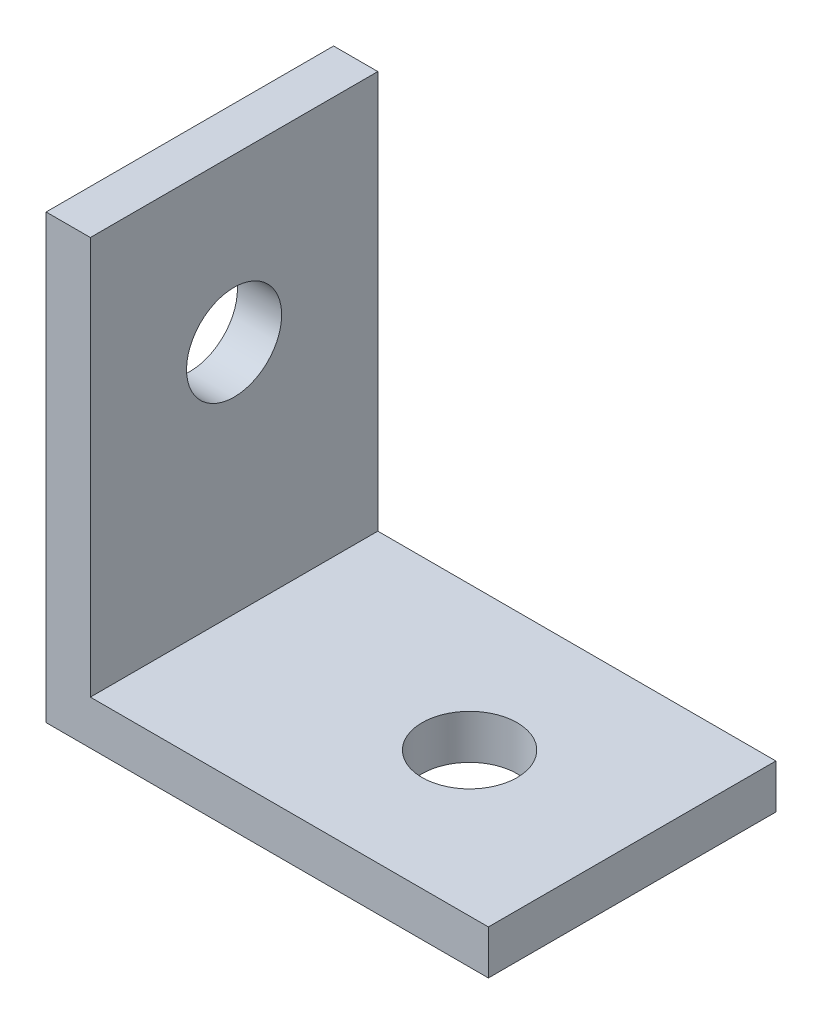
ISO-10303-21;
HEADER;
FILE_DESCRIPTION(('STEP AP214'),'2;1');
FILE_NAME('part.step','',(''),(''),'','','');
FILE_SCHEMA(('AUTOMOTIVE_DESIGN { 1 0 10303 214 1 1 1 1 }'));
ENDSEC;
DATA;
#1=APPLICATION_CONTEXT('core data for automotive mechanical design processes');
#2=APPLICATION_PROTOCOL_DEFINITION('international standard','automotive_design',2000,#1);
#3=PRODUCT_CONTEXT('',#1,'mechanical');
#4=PRODUCT('Part','Part','',(#3));
#5=PRODUCT_RELATED_PRODUCT_CATEGORY('part','',(#4));
#6=PRODUCT_DEFINITION_FORMATION('','',#4);
#7=PRODUCT_DEFINITION_CONTEXT('part definition',#1,'design');
#8=PRODUCT_DEFINITION('design','',#6,#7);
#9=PRODUCT_DEFINITION_SHAPE('','',#8);
#10=(LENGTH_UNIT() NAMED_UNIT(*) SI_UNIT(.MILLI.,.METRE.));
#11=(NAMED_UNIT(*) PLANE_ANGLE_UNIT() SI_UNIT($,.RADIAN.));
#12=(NAMED_UNIT(*) SI_UNIT($,.STERADIAN.) SOLID_ANGLE_UNIT());
#13=UNCERTAINTY_MEASURE_WITH_UNIT(LENGTH_MEASURE(1.E-05),#10,'distance_accuracy_value','');
#14=(GEOMETRIC_REPRESENTATION_CONTEXT(3) GLOBAL_UNCERTAINTY_ASSIGNED_CONTEXT((#13)) GLOBAL_UNIT_ASSIGNED_CONTEXT((#10,
#11,#12)) REPRESENTATION_CONTEXT('',''));
#15=CARTESIAN_POINT('',(0.,0.,0.));
#16=DIRECTION('',(0.,0.,1.));
#17=DIRECTION('',(1.,0.,0.));
#18=AXIS2_PLACEMENT_3D('',#15,#16,#17);
#19=CARTESIAN_POINT('',(2.,20.,13.));
#20=DIRECTION('',(0.,-1.,0.));
#21=DIRECTION('',(0.,0.,-1.));
#22=AXIS2_PLACEMENT_3D('',#19,#20,#21);
#23=PLANE('',#22);
#24=DIRECTION('',(-1.,0.,0.));
#25=VECTOR('',#24,1.);
#26=CARTESIAN_POINT('',(2.,20.,0.));
#27=LINE('',#26,#25);
#28=CARTESIAN_POINT('',(2.,20.,0.));
#29=VERTEX_POINT('',#28);
#30=CARTESIAN_POINT('',(0.,20.,0.));
#31=VERTEX_POINT('',#30);
#32=EDGE_CURVE('E119',#29,#31,#27,.T.);
#33=ORIENTED_EDGE('',*,*,#32,.T.);
#34=DIRECTION('',(0.,0.,-1.));
#35=VECTOR('',#34,1.);
#36=CARTESIAN_POINT('',(0.,20.,13.));
#37=LINE('',#36,#35);
#38=CARTESIAN_POINT('',(0.,20.,13.));
#39=VERTEX_POINT('',#38);
#40=EDGE_CURVE('E11',#39,#31,#37,.T.);
#41=ORIENTED_EDGE('',*,*,#40,.F.);
#42=DIRECTION('',(-1.,0.,0.));
#43=VECTOR('',#42,1.);
#44=CARTESIAN_POINT('',(2.,20.,13.));
#45=LINE('',#44,#43);
#46=CARTESIAN_POINT('',(2.,20.,13.));
#47=VERTEX_POINT('',#46);
#48=EDGE_CURVE('E130',#47,#39,#45,.T.);
#49=ORIENTED_EDGE('',*,*,#48,.F.);
#50=DIRECTION('',(0.,0.,-1.));
#51=VECTOR('',#50,1.);
#52=CARTESIAN_POINT('',(2.,20.,13.));
#53=LINE('',#52,#51);
#54=EDGE_CURVE('E115',#47,#29,#53,.T.);
#55=ORIENTED_EDGE('',*,*,#54,.T.);
#56=EDGE_LOOP('',(#33,#41,#49,#55));
#57=FACE_BOUND('',#56,.T.);
#58=ADVANCED_FACE('F33',(#57),#23,.F.);
#59=CARTESIAN_POINT('',(0.,20.,13.));
#60=DIRECTION('',(1.,0.,0.));
#61=DIRECTION('',(0.,1.,0.));
#62=AXIS2_PLACEMENT_3D('',#59,#60,#61);
#63=PLANE('',#62);
#64=CARTESIAN_POINT('',(0.,12.65,6.5));
#65=DIRECTION('',(-1.,0.,0.));
#66=DIRECTION('',(0.,-1.,0.));
#67=AXIS2_PLACEMENT_3D('',#64,#65,#66);
#68=CIRCLE('',#67,2.15);
#69=CARTESIAN_POINT('',(0.,10.5,6.5));
#70=VERTEX_POINT('',#69);
#71=EDGE_CURVE('E136',#70,#70,#68,.T.);
#72=ORIENTED_EDGE('',*,*,#71,.F.);
#73=EDGE_LOOP('',(#72));
#74=FACE_BOUND('',#73,.T.);
#75=DIRECTION('',(0.,-1.,0.));
#76=VECTOR('',#75,1.);
#77=CARTESIAN_POINT('',(0.,20.,0.));
#78=LINE('',#77,#76);
#79=CARTESIAN_POINT('',(0.,0.,0.));
#80=VERTEX_POINT('',#79);
#81=EDGE_CURVE('E122',#31,#80,#78,.T.);
#82=ORIENTED_EDGE('',*,*,#81,.T.);
#83=DIRECTION('',(0.,0.,-1.));
#84=VECTOR('',#83,1.);
#85=CARTESIAN_POINT('',(0.,0.,13.));
#86=LINE('',#85,#84);
#87=CARTESIAN_POINT('',(0.,0.,13.));
#88=VERTEX_POINT('',#87);
#89=EDGE_CURVE('E42',#88,#80,#86,.T.);
#90=ORIENTED_EDGE('',*,*,#89,.F.);
#91=DIRECTION('',(0.,-1.,0.));
#92=VECTOR('',#91,1.);
#93=CARTESIAN_POINT('',(0.,20.,13.));
#94=LINE('',#93,#92);
#95=EDGE_CURVE('E88',#39,#88,#94,.T.);
#96=ORIENTED_EDGE('',*,*,#95,.F.);
#97=ORIENTED_EDGE('',*,*,#40,.T.);
#98=EDGE_LOOP('',(#82,#90,#96,#97));
#99=FACE_BOUND('',#98,.T.);
#100=ADVANCED_FACE('F150',(#74,#99),#63,.F.);
#101=CARTESIAN_POINT('',(0.,0.,13.));
#102=DIRECTION('',(0.,1.,0.));
#103=DIRECTION('',(0.,0.,1.));
#104=AXIS2_PLACEMENT_3D('',#101,#102,#103);
#105=PLANE('',#104);
#106=CARTESIAN_POINT('',(12.65,0.,6.5));
#107=DIRECTION('',(0.,-1.,0.));
#108=DIRECTION('',(0.,0.,-1.));
#109=AXIS2_PLACEMENT_3D('',#106,#107,#108);
#110=CIRCLE('',#109,2.15);
#111=CARTESIAN_POINT('',(12.65,0.,4.35));
#112=VERTEX_POINT('',#111);
#113=EDGE_CURVE('E144',#112,#112,#110,.T.);
#114=ORIENTED_EDGE('',*,*,#113,.F.);
#115=EDGE_LOOP('',(#114));
#116=FACE_BOUND('',#115,.T.);
#117=DIRECTION('',(1.,0.,0.));
#118=VECTOR('',#117,1.);
#119=CARTESIAN_POINT('',(0.,0.,0.));
#120=LINE('',#119,#118);
#121=CARTESIAN_POINT('',(20.,0.,0.));
#122=VERTEX_POINT('',#121);
#123=EDGE_CURVE('E125',#80,#122,#120,.T.);
#124=ORIENTED_EDGE('',*,*,#123,.T.);
#125=DIRECTION('',(0.,0.,-1.));
#126=VECTOR('',#125,1.);
#127=CARTESIAN_POINT('',(20.,0.,13.));
#128=LINE('',#127,#126);
#129=CARTESIAN_POINT('',(20.,0.,13.));
#130=VERTEX_POINT('',#129);
#131=EDGE_CURVE('E110',#130,#122,#128,.T.);
#132=ORIENTED_EDGE('',*,*,#131,.F.);
#133=DIRECTION('',(1.,0.,0.));
#134=VECTOR('',#133,1.);
#135=CARTESIAN_POINT('',(0.,0.,13.));
#136=LINE('',#135,#134);
#137=EDGE_CURVE('E101',#88,#130,#136,.T.);
#138=ORIENTED_EDGE('',*,*,#137,.F.);
#139=ORIENTED_EDGE('',*,*,#89,.T.);
#140=EDGE_LOOP('',(#124,#132,#138,#139));
#141=FACE_BOUND('',#140,.T.);
#142=ADVANCED_FACE('F153',(#116,#141),#105,.F.);
#143=CARTESIAN_POINT('',(20.,0.,13.));
#144=DIRECTION('',(-1.,0.,0.));
#145=DIRECTION('',(0.,0.,1.));
#146=AXIS2_PLACEMENT_3D('',#143,#144,#145);
#147=PLANE('',#146);
#148=DIRECTION('',(0.,1.,0.));
#149=VECTOR('',#148,1.);
#150=CARTESIAN_POINT('',(20.,0.,0.));
#151=LINE('',#150,#149);
#152=CARTESIAN_POINT('',(20.,2.,0.));
#153=VERTEX_POINT('',#152);
#154=EDGE_CURVE('E109',#122,#153,#151,.T.);
#155=ORIENTED_EDGE('',*,*,#154,.T.);
#156=DIRECTION('',(0.,0.,-1.));
#157=VECTOR('',#156,1.);
#158=CARTESIAN_POINT('',(20.,2.,13.));
#159=LINE('',#158,#157);
#160=CARTESIAN_POINT('',(20.,2.,13.));
#161=VERTEX_POINT('',#160);
#162=EDGE_CURVE('E106',#161,#153,#159,.T.);
#163=ORIENTED_EDGE('',*,*,#162,.F.);
#164=DIRECTION('',(0.,1.,0.));
#165=VECTOR('',#164,1.);
#166=CARTESIAN_POINT('',(20.,0.,13.));
#167=LINE('',#166,#165);
#168=EDGE_CURVE('E95',#130,#161,#167,.T.);
#169=ORIENTED_EDGE('',*,*,#168,.F.);
#170=ORIENTED_EDGE('',*,*,#131,.T.);
#171=EDGE_LOOP('',(#155,#163,#169,#170));
#172=FACE_BOUND('',#171,.T.);
#173=ADVANCED_FACE('F107',(#172),#147,.F.);
#174=CARTESIAN_POINT('',(20.,2.,13.));
#175=DIRECTION('',(0.,-1.,0.));
#176=DIRECTION('',(1.,0.,0.));
#177=AXIS2_PLACEMENT_3D('',#174,#175,#176);
#178=PLANE('',#177);
#179=CARTESIAN_POINT('',(12.65,2.,6.5));
#180=DIRECTION('',(0.,-1.,0.));
#181=DIRECTION('',(1.,0.,0.));
#182=AXIS2_PLACEMENT_3D('',#179,#180,#181);
#183=CIRCLE('',#182,2.15);
#184=CARTESIAN_POINT('',(14.8,2.,6.5));
#185=VERTEX_POINT('',#184);
#186=EDGE_CURVE('E36',#185,#185,#183,.T.);
#187=ORIENTED_EDGE('',*,*,#186,.T.);
#188=EDGE_LOOP('',(#187));
#189=FACE_BOUND('',#188,.T.);
#190=DIRECTION('',(-1.,0.,0.));
#191=VECTOR('',#190,1.);
#192=CARTESIAN_POINT('',(20.,2.,0.));
#193=LINE('',#192,#191);
#194=CARTESIAN_POINT('',(2.,2.,0.));
#195=VERTEX_POINT('',#194);
#196=EDGE_CURVE('E74',#153,#195,#193,.T.);
#197=ORIENTED_EDGE('',*,*,#196,.T.);
#198=DIRECTION('',(0.,0.,-1.));
#199=VECTOR('',#198,1.);
#200=CARTESIAN_POINT('',(2.,2.,13.));
#201=LINE('',#200,#199);
#202=CARTESIAN_POINT('',(2.,2.,13.));
#203=VERTEX_POINT('',#202);
#204=EDGE_CURVE('E111',#203,#195,#201,.T.);
#205=ORIENTED_EDGE('',*,*,#204,.F.);
#206=DIRECTION('',(-1.,0.,0.));
#207=VECTOR('',#206,1.);
#208=CARTESIAN_POINT('',(20.,2.,13.));
#209=LINE('',#208,#207);
#210=EDGE_CURVE('E99',#161,#203,#209,.T.);
#211=ORIENTED_EDGE('',*,*,#210,.F.);
#212=ORIENTED_EDGE('',*,*,#162,.T.);
#213=EDGE_LOOP('',(#197,#205,#211,#212));
#214=FACE_BOUND('',#213,.T.);
#215=ADVANCED_FACE('F113',(#189,#214),#178,.F.);
#216=CARTESIAN_POINT('',(2.,2.,13.));
#217=DIRECTION('',(-1.,0.,0.));
#218=DIRECTION('',(0.,-1.,0.));
#219=AXIS2_PLACEMENT_3D('',#216,#217,#218);
#220=PLANE('',#219);
#221=CARTESIAN_POINT('',(2.,12.65,6.5));
#222=DIRECTION('',(-1.,0.,0.));
#223=DIRECTION('',(0.,-1.,0.));
#224=AXIS2_PLACEMENT_3D('',#221,#222,#223);
#225=CIRCLE('',#224,2.15);
#226=CARTESIAN_POINT('',(2.,10.5,6.5));
#227=VERTEX_POINT('',#226);
#228=EDGE_CURVE('E123',#227,#227,#225,.T.);
#229=ORIENTED_EDGE('',*,*,#228,.T.);
#230=EDGE_LOOP('',(#229));
#231=FACE_BOUND('',#230,.T.);
#232=DIRECTION('',(0.,1.,0.));
#233=VECTOR('',#232,1.);
#234=CARTESIAN_POINT('',(2.,2.,0.));
#235=LINE('',#234,#233);
#236=EDGE_CURVE('E80',#195,#29,#235,.T.);
#237=ORIENTED_EDGE('',*,*,#236,.T.);
#238=ORIENTED_EDGE('',*,*,#54,.F.);
#239=DIRECTION('',(0.,1.,0.));
#240=VECTOR('',#239,1.);
#241=CARTESIAN_POINT('',(2.,2.,13.));
#242=LINE('',#241,#240);
#243=EDGE_CURVE('E51',#203,#47,#242,.T.);
#244=ORIENTED_EDGE('',*,*,#243,.F.);
#245=ORIENTED_EDGE('',*,*,#204,.T.);
#246=EDGE_LOOP('',(#237,#238,#244,#245));
#247=FACE_BOUND('',#246,.T.);
#248=ADVANCED_FACE('F158',(#231,#247),#220,.F.);
#249=CARTESIAN_POINT('',(0.,0.,13.));
#250=DIRECTION('',(0.,0.,1.));
#251=DIRECTION('',(1.,0.,0.));
#252=AXIS2_PLACEMENT_3D('',#249,#250,#251);
#253=PLANE('',#252);
#254=ORIENTED_EDGE('',*,*,#48,.T.);
#255=ORIENTED_EDGE('',*,*,#95,.T.);
#256=ORIENTED_EDGE('',*,*,#137,.T.);
#257=ORIENTED_EDGE('',*,*,#168,.T.);
#258=ORIENTED_EDGE('',*,*,#210,.T.);
#259=ORIENTED_EDGE('',*,*,#243,.T.);
#260=EDGE_LOOP('',(#254,#255,#256,#257,#258,#259));
#261=FACE_BOUND('',#260,.T.);
#262=ADVANCED_FACE('F97',(#261),#253,.T.);
#263=CARTESIAN_POINT('',(0.,0.,0.));
#264=DIRECTION('',(0.,0.,1.));
#265=DIRECTION('',(1.,0.,0.));
#266=AXIS2_PLACEMENT_3D('',#263,#264,#265);
#267=PLANE('',#266);
#268=ORIENTED_EDGE('',*,*,#32,.F.);
#269=ORIENTED_EDGE('',*,*,#236,.F.);
#270=ORIENTED_EDGE('',*,*,#196,.F.);
#271=ORIENTED_EDGE('',*,*,#154,.F.);
#272=ORIENTED_EDGE('',*,*,#123,.F.);
#273=ORIENTED_EDGE('',*,*,#81,.F.);
#274=EDGE_LOOP('',(#268,#269,#270,#271,#272,#273));
#275=FACE_BOUND('',#274,.T.);
#276=ADVANCED_FACE('F156',(#275),#267,.F.);
#277=CARTESIAN_POINT('',(20.,12.65,6.5));
#278=DIRECTION('',(-1.,0.,0.));
#279=DIRECTION('',(0.,-1.,0.));
#280=AXIS2_PLACEMENT_3D('',#277,#278,#279);
#281=CYLINDRICAL_SURFACE('',#280,2.15);
#282=ORIENTED_EDGE('',*,*,#71,.T.);
#283=EDGE_LOOP('',(#282));
#284=FACE_BOUND('',#283,.T.);
#285=ORIENTED_EDGE('',*,*,#228,.F.);
#286=EDGE_LOOP('',(#285));
#287=FACE_BOUND('',#286,.T.);
#288=ADVANCED_FACE('F203',(#284,#287),#281,.F.);
#289=CARTESIAN_POINT('',(12.65,20.,6.5));
#290=DIRECTION('',(0.,-1.,0.));
#291=DIRECTION('',(0.,0.,-1.));
#292=AXIS2_PLACEMENT_3D('',#289,#290,#291);
#293=CYLINDRICAL_SURFACE('',#292,2.15);
#294=ORIENTED_EDGE('',*,*,#113,.T.);
#295=EDGE_LOOP('',(#294));
#296=FACE_BOUND('',#295,.T.);
#297=ORIENTED_EDGE('',*,*,#186,.F.);
#298=EDGE_LOOP('',(#297));
#299=FACE_BOUND('',#298,.T.);
#300=ADVANCED_FACE('F199',(#296,#299),#293,.F.);
#301=CLOSED_SHELL('',(#58,#100,#142,#173,#215,#248,#262,#276,#288,#300));
#302=MANIFOLD_SOLID_BREP('B2',#301);
#303=ADVANCED_BREP_SHAPE_REPRESENTATION('',(#18,#302),#14);
#304=SHAPE_DEFINITION_REPRESENTATION(#9,#303);
ENDSEC;
END-ISO-10303-21;
